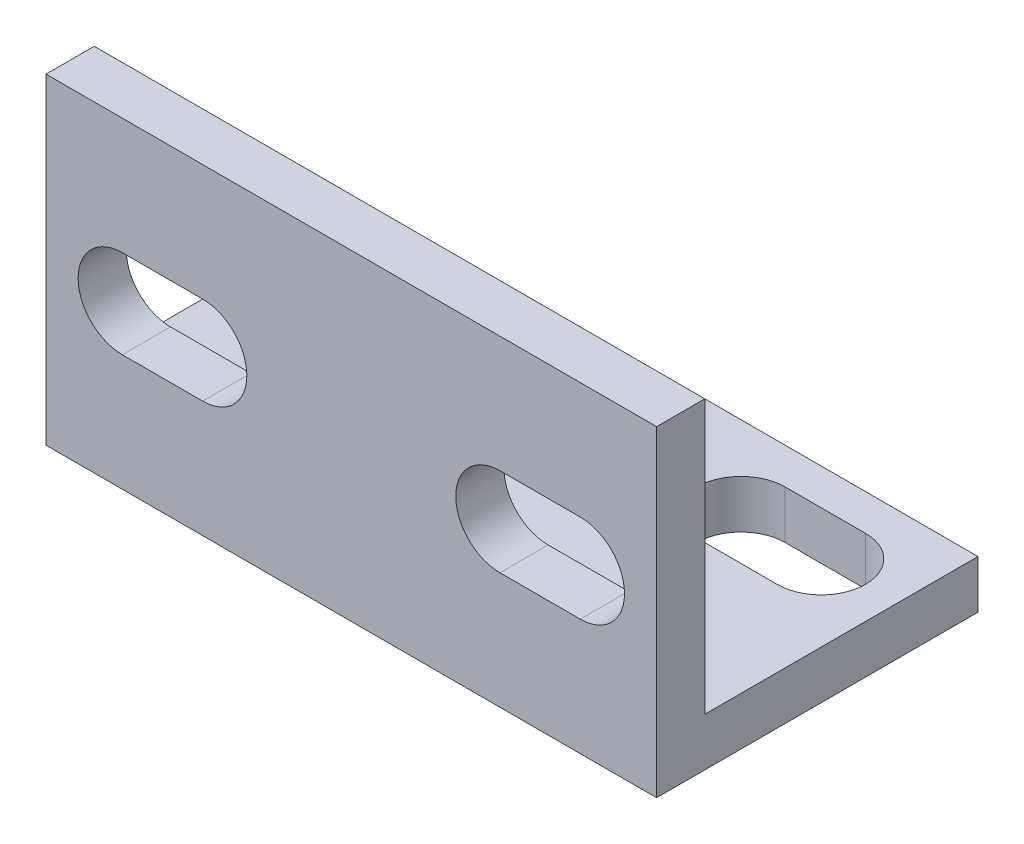
ISO-10303-21;
HEADER;
FILE_DESCRIPTION(('STEP AP214'),'2;1');
FILE_NAME('part.step','',(''),(''),'','','');
FILE_SCHEMA(('AUTOMOTIVE_DESIGN { 1 0 10303 214 1 1 1 1 }'));
ENDSEC;
DATA;
#1=APPLICATION_CONTEXT('core data for automotive mechanical design processes');
#2=APPLICATION_PROTOCOL_DEFINITION('international standard','automotive_design',2000,#1);
#3=PRODUCT_CONTEXT('',#1,'mechanical');
#4=PRODUCT('Part','Part','',(#3));
#5=PRODUCT_RELATED_PRODUCT_CATEGORY('part','',(#4));
#6=PRODUCT_DEFINITION_FORMATION('','',#4);
#7=PRODUCT_DEFINITION_CONTEXT('part definition',#1,'design');
#8=PRODUCT_DEFINITION('design','',#6,#7);
#9=PRODUCT_DEFINITION_SHAPE('','',#8);
#10=(LENGTH_UNIT() NAMED_UNIT(*) SI_UNIT(.MILLI.,.METRE.));
#11=(NAMED_UNIT(*) PLANE_ANGLE_UNIT() SI_UNIT($,.RADIAN.));
#12=(NAMED_UNIT(*) SI_UNIT($,.STERADIAN.) SOLID_ANGLE_UNIT());
#13=UNCERTAINTY_MEASURE_WITH_UNIT(LENGTH_MEASURE(1.E-05),#10,'distance_accuracy_value','');
#14=(GEOMETRIC_REPRESENTATION_CONTEXT(3) GLOBAL_UNCERTAINTY_ASSIGNED_CONTEXT((#13)) GLOBAL_UNIT_ASSIGNED_CONTEXT((#10,
#11,#12)) REPRESENTATION_CONTEXT('',''));
#15=CARTESIAN_POINT('',(0.,0.,0.));
#16=DIRECTION('',(0.,0.,1.));
#17=DIRECTION('',(1.,0.,0.));
#18=AXIS2_PLACEMENT_3D('',#15,#16,#17);
#19=CARTESIAN_POINT('',(-38.,3.,-20.));
#20=DIRECTION('',(0.,1.,0.));
#21=DIRECTION('',(0.,0.,1.));
#22=AXIS2_PLACEMENT_3D('',#19,#20,#21);
#23=PLANE('',#22);
#24=DIRECTION('',(0.,0.,1.));
#25=VECTOR('',#24,1.);
#26=CARTESIAN_POINT('',(0.,3.,-20.));
#27=LINE('',#26,#25);
#28=CARTESIAN_POINT('',(0.,3.,-20.));
#29=VERTEX_POINT('',#28);
#30=CARTESIAN_POINT('',(0.,3.,-3.));
#31=VERTEX_POINT('',#30);
#32=EDGE_CURVE('E342',#29,#31,#27,.T.);
#33=ORIENTED_EDGE('',*,*,#32,.F.);
#34=DIRECTION('',(1.,0.,0.));
#35=VECTOR('',#34,1.);
#36=CARTESIAN_POINT('',(-38.,3.,-20.));
#37=LINE('',#36,#35);
#38=CARTESIAN_POINT('',(-38.,3.,-20.));
#39=VERTEX_POINT('',#38);
#40=EDGE_CURVE('E348',#39,#29,#37,.T.);
#41=ORIENTED_EDGE('',*,*,#40,.F.);
#42=DIRECTION('',(0.,0.,1.));
#43=VECTOR('',#42,1.);
#44=CARTESIAN_POINT('',(-38.,3.,-20.));
#45=LINE('',#44,#43);
#46=CARTESIAN_POINT('',(-38.,3.,-3.));
#47=VERTEX_POINT('',#46);
#48=EDGE_CURVE('E325',#39,#47,#45,.T.);
#49=ORIENTED_EDGE('',*,*,#48,.T.);
#50=DIRECTION('',(1.,0.,0.));
#51=VECTOR('',#50,1.);
#52=CARTESIAN_POINT('',(-38.,3.,-3.));
#53=LINE('',#52,#51);
#54=EDGE_CURVE('E41',#47,#31,#53,.T.);
#55=ORIENTED_EDGE('',*,*,#54,.T.);
#56=EDGE_LOOP('',(#33,#41,#49,#55));
#57=FACE_BOUND('',#56,.T.);
#58=CARTESIAN_POINT('',(-4.75,3.,-15.));
#59=DIRECTION('',(0.,1.,0.));
#60=DIRECTION('',(0.,0.,1.));
#61=AXIS2_PLACEMENT_3D('',#58,#59,#60);
#62=CIRCLE('',#61,2.75);
#63=CARTESIAN_POINT('',(-4.75,3.,-12.25));
#64=VERTEX_POINT('',#63);
#65=CARTESIAN_POINT('',(-4.75,3.,-17.75));
#66=VERTEX_POINT('',#65);
#67=EDGE_CURVE('E242',#64,#66,#62,.T.);
#68=ORIENTED_EDGE('',*,*,#67,.F.);
#69=DIRECTION('',(1.,0.,0.));
#70=VECTOR('',#69,1.);
#71=CARTESIAN_POINT('',(-4.75,3.,-12.25));
#72=LINE('',#71,#70);
#73=CARTESIAN_POINT('',(-9.75,3.,-12.25));
#74=VERTEX_POINT('',#73);
#75=EDGE_CURVE('E253',#74,#64,#72,.T.);
#76=ORIENTED_EDGE('',*,*,#75,.F.);
#77=CARTESIAN_POINT('',(-9.75,3.,-15.));
#78=DIRECTION('',(0.,1.,0.));
#79=DIRECTION('',(0.,0.,1.));
#80=AXIS2_PLACEMENT_3D('',#77,#78,#79);
#81=CIRCLE('',#80,2.75);
#82=CARTESIAN_POINT('',(-9.75,3.,-17.75));
#83=VERTEX_POINT('',#82);
#84=EDGE_CURVE('E267',#83,#74,#81,.T.);
#85=ORIENTED_EDGE('',*,*,#84,.F.);
#86=DIRECTION('',(-1.,0.,0.));
#87=VECTOR('',#86,1.);
#88=CARTESIAN_POINT('',(-4.75,3.,-17.75));
#89=LINE('',#88,#87);
#90=EDGE_CURVE('E264',#66,#83,#89,.T.);
#91=ORIENTED_EDGE('',*,*,#90,.F.);
#92=EDGE_LOOP('',(#68,#76,#85,#91));
#93=FACE_BOUND('',#92,.T.);
#94=DIRECTION('',(-1.,0.,0.));
#95=VECTOR('',#94,1.);
#96=CARTESIAN_POINT('',(-33.25,3.,-12.25));
#97=LINE('',#96,#95);
#98=CARTESIAN_POINT('',(-28.25,3.,-12.25));
#99=VERTEX_POINT('',#98);
#100=CARTESIAN_POINT('',(-33.25,3.,-12.25));
#101=VERTEX_POINT('',#100);
#102=EDGE_CURVE('E207',#99,#101,#97,.T.);
#103=ORIENTED_EDGE('',*,*,#102,.T.);
#104=CARTESIAN_POINT('',(-33.25,3.,-15.));
#105=DIRECTION('',(0.,-1.,0.));
#106=DIRECTION('',(0.,0.,1.));
#107=AXIS2_PLACEMENT_3D('',#104,#105,#106);
#108=CIRCLE('',#107,2.75);
#109=CARTESIAN_POINT('',(-33.25,3.,-17.75));
#110=VERTEX_POINT('',#109);
#111=EDGE_CURVE('E49',#101,#110,#108,.T.);
#112=ORIENTED_EDGE('',*,*,#111,.T.);
#113=DIRECTION('',(1.,0.,0.));
#114=VECTOR('',#113,1.);
#115=CARTESIAN_POINT('',(-33.25,3.,-17.75));
#116=LINE('',#115,#114);
#117=CARTESIAN_POINT('',(-28.25,3.,-17.75));
#118=VERTEX_POINT('',#117);
#119=EDGE_CURVE('E198',#110,#118,#116,.T.);
#120=ORIENTED_EDGE('',*,*,#119,.T.);
#121=CARTESIAN_POINT('',(-28.25,3.,-15.));
#122=DIRECTION('',(0.,-1.,0.));
#123=DIRECTION('',(0.,0.,1.));
#124=AXIS2_PLACEMENT_3D('',#121,#122,#123);
#125=CIRCLE('',#124,2.75);
#126=EDGE_CURVE('E201',#118,#99,#125,.T.);
#127=ORIENTED_EDGE('',*,*,#126,.T.);
#128=EDGE_LOOP('',(#103,#112,#120,#127));
#129=FACE_BOUND('',#128,.T.);
#130=ADVANCED_FACE('F32',(#57,#93,#129),#23,.T.);
#131=CARTESIAN_POINT('',(-38.,0.,0.));
#132=DIRECTION('',(0.,-1.,0.));
#133=DIRECTION('',(0.,0.,-1.));
#134=AXIS2_PLACEMENT_3D('',#131,#132,#133);
#135=PLANE('',#134);
#136=DIRECTION('',(0.,0.,-1.));
#137=VECTOR('',#136,1.);
#138=CARTESIAN_POINT('',(0.,0.,0.));
#139=LINE('',#138,#137);
#140=CARTESIAN_POINT('',(0.,0.,0.));
#141=VERTEX_POINT('',#140);
#142=CARTESIAN_POINT('',(0.,0.,-20.));
#143=VERTEX_POINT('',#142);
#144=EDGE_CURVE('E336',#141,#143,#139,.T.);
#145=ORIENTED_EDGE('',*,*,#144,.F.);
#146=DIRECTION('',(1.,0.,0.));
#147=VECTOR('',#146,1.);
#148=CARTESIAN_POINT('',(-38.,0.,0.));
#149=LINE('',#148,#147);
#150=CARTESIAN_POINT('',(-38.,0.,0.));
#151=VERTEX_POINT('',#150);
#152=EDGE_CURVE('E351',#151,#141,#149,.T.);
#153=ORIENTED_EDGE('',*,*,#152,.F.);
#154=DIRECTION('',(0.,0.,-1.));
#155=VECTOR('',#154,1.);
#156=CARTESIAN_POINT('',(-38.,0.,0.));
#157=LINE('',#156,#155);
#158=CARTESIAN_POINT('',(-38.,0.,-20.));
#159=VERTEX_POINT('',#158);
#160=EDGE_CURVE('E319',#151,#159,#157,.T.);
#161=ORIENTED_EDGE('',*,*,#160,.T.);
#162=DIRECTION('',(1.,0.,0.));
#163=VECTOR('',#162,1.);
#164=CARTESIAN_POINT('',(-38.,0.,-20.));
#165=LINE('',#164,#163);
#166=EDGE_CURVE('E350',#159,#143,#165,.T.);
#167=ORIENTED_EDGE('',*,*,#166,.T.);
#168=EDGE_LOOP('',(#145,#153,#161,#167));
#169=FACE_BOUND('',#168,.T.);
#170=CARTESIAN_POINT('',(-4.75,0.,-15.));
#171=DIRECTION('',(0.,1.,0.));
#172=DIRECTION('',(0.,0.,1.));
#173=AXIS2_PLACEMENT_3D('',#170,#171,#172);
#174=CIRCLE('',#173,2.75);
#175=CARTESIAN_POINT('',(-4.75,0.,-12.25));
#176=VERTEX_POINT('',#175);
#177=CARTESIAN_POINT('',(-4.75,0.,-17.75));
#178=VERTEX_POINT('',#177);
#179=EDGE_CURVE('E249',#176,#178,#174,.T.);
#180=ORIENTED_EDGE('',*,*,#179,.T.);
#181=DIRECTION('',(-1.,0.,0.));
#182=VECTOR('',#181,1.);
#183=CARTESIAN_POINT('',(-4.75,0.,-17.75));
#184=LINE('',#183,#182);
#185=CARTESIAN_POINT('',(-9.75,0.,-17.75));
#186=VERTEX_POINT('',#185);
#187=EDGE_CURVE('E252',#178,#186,#184,.T.);
#188=ORIENTED_EDGE('',*,*,#187,.T.);
#189=CARTESIAN_POINT('',(-9.75,0.,-15.));
#190=DIRECTION('',(0.,1.,0.));
#191=DIRECTION('',(0.,0.,1.));
#192=AXIS2_PLACEMENT_3D('',#189,#190,#191);
#193=CIRCLE('',#192,2.75);
#194=CARTESIAN_POINT('',(-9.75,0.,-12.25));
#195=VERTEX_POINT('',#194);
#196=EDGE_CURVE('E256',#186,#195,#193,.T.);
#197=ORIENTED_EDGE('',*,*,#196,.T.);
#198=DIRECTION('',(1.,0.,0.));
#199=VECTOR('',#198,1.);
#200=CARTESIAN_POINT('',(-4.75,0.,-12.25));
#201=LINE('',#200,#199);
#202=EDGE_CURVE('E259',#195,#176,#201,.T.);
#203=ORIENTED_EDGE('',*,*,#202,.T.);
#204=EDGE_LOOP('',(#180,#188,#197,#203));
#205=FACE_BOUND('',#204,.T.);
#206=DIRECTION('',(1.,0.,0.));
#207=VECTOR('',#206,1.);
#208=CARTESIAN_POINT('',(-33.25,0.,-17.75));
#209=LINE('',#208,#207);
#210=CARTESIAN_POINT('',(-33.25,0.,-17.75));
#211=VERTEX_POINT('',#210);
#212=CARTESIAN_POINT('',(-28.25,0.,-17.75));
#213=VERTEX_POINT('',#212);
#214=EDGE_CURVE('E194',#211,#213,#209,.T.);
#215=ORIENTED_EDGE('',*,*,#214,.F.);
#216=CARTESIAN_POINT('',(-33.25,0.,-15.));
#217=DIRECTION('',(0.,-1.,0.));
#218=DIRECTION('',(0.,0.,1.));
#219=AXIS2_PLACEMENT_3D('',#216,#217,#218);
#220=CIRCLE('',#219,2.75);
#221=CARTESIAN_POINT('',(-33.25,0.,-12.25));
#222=VERTEX_POINT('',#221);
#223=EDGE_CURVE('E190',#222,#211,#220,.T.);
#224=ORIENTED_EDGE('',*,*,#223,.F.);
#225=DIRECTION('',(-1.,0.,0.));
#226=VECTOR('',#225,1.);
#227=CARTESIAN_POINT('',(-33.25,0.,-12.25));
#228=LINE('',#227,#226);
#229=CARTESIAN_POINT('',(-28.25,0.,-12.25));
#230=VERTEX_POINT('',#229);
#231=EDGE_CURVE('E182',#230,#222,#228,.T.);
#232=ORIENTED_EDGE('',*,*,#231,.F.);
#233=CARTESIAN_POINT('',(-28.25,0.,-15.));
#234=DIRECTION('',(0.,-1.,0.));
#235=DIRECTION('',(0.,0.,1.));
#236=AXIS2_PLACEMENT_3D('',#233,#234,#235);
#237=CIRCLE('',#236,2.75);
#238=EDGE_CURVE('E189',#213,#230,#237,.T.);
#239=ORIENTED_EDGE('',*,*,#238,.F.);
#240=EDGE_LOOP('',(#215,#224,#232,#239));
#241=FACE_BOUND('',#240,.T.);
#242=ADVANCED_FACE('F197',(#169,#205,#241),#135,.T.);
#243=CARTESIAN_POINT('',(-38.,3.,-3.));
#244=DIRECTION('',(0.,0.,-1.));
#245=DIRECTION('',(0.,1.,0.));
#246=AXIS2_PLACEMENT_3D('',#243,#244,#245);
#247=PLANE('',#246);
#248=DIRECTION('',(0.,1.,0.));
#249=VECTOR('',#248,1.);
#250=CARTESIAN_POINT('',(0.,3.,-3.));
#251=LINE('',#250,#249);
#252=CARTESIAN_POINT('',(0.,20.,-3.));
#253=VERTEX_POINT('',#252);
#254=EDGE_CURVE('E316',#31,#253,#251,.T.);
#255=ORIENTED_EDGE('',*,*,#254,.F.);
#256=ORIENTED_EDGE('',*,*,#54,.F.);
#257=DIRECTION('',(0.,1.,0.));
#258=VECTOR('',#257,1.);
#259=CARTESIAN_POINT('',(-38.,3.,-3.));
#260=LINE('',#259,#258);
#261=CARTESIAN_POINT('',(-38.,20.,-3.));
#262=VERTEX_POINT('',#261);
#263=EDGE_CURVE('E328',#47,#262,#260,.T.);
#264=ORIENTED_EDGE('',*,*,#263,.T.);
#265=DIRECTION('',(1.,0.,0.));
#266=VECTOR('',#265,1.);
#267=CARTESIAN_POINT('',(-38.,20.,-3.));
#268=LINE('',#267,#266);
#269=EDGE_CURVE('E11',#262,#253,#268,.T.);
#270=ORIENTED_EDGE('',*,*,#269,.T.);
#271=EDGE_LOOP('',(#255,#256,#264,#270));
#272=FACE_BOUND('',#271,.T.);
#273=CARTESIAN_POINT('',(-4.75,10.,-3.));
#274=DIRECTION('',(0.,0.,-1.));
#275=DIRECTION('',(0.,1.,0.));
#276=AXIS2_PLACEMENT_3D('',#273,#274,#275);
#277=CIRCLE('',#276,2.75);
#278=CARTESIAN_POINT('',(-4.75,12.75,-3.));
#279=VERTEX_POINT('',#278);
#280=CARTESIAN_POINT('',(-4.75,7.25000000000001,-3.));
#281=VERTEX_POINT('',#280);
#282=EDGE_CURVE('E274',#279,#281,#277,.T.);
#283=ORIENTED_EDGE('',*,*,#282,.F.);
#284=DIRECTION('',(-1.,0.,0.));
#285=VECTOR('',#284,1.);
#286=CARTESIAN_POINT('',(-4.75,12.75,-3.));
#287=LINE('',#286,#285);
#288=CARTESIAN_POINT('',(-9.75,12.75,-3.));
#289=VERTEX_POINT('',#288);
#290=EDGE_CURVE('E285',#279,#289,#287,.T.);
#291=ORIENTED_EDGE('',*,*,#290,.T.);
#292=CARTESIAN_POINT('',(-9.75,10.,-3.));
#293=DIRECTION('',(0.,0.,-1.));
#294=DIRECTION('',(0.,1.,0.));
#295=AXIS2_PLACEMENT_3D('',#292,#293,#294);
#296=CIRCLE('',#295,2.75);
#297=CARTESIAN_POINT('',(-9.75,7.25000000000001,-3.));
#298=VERTEX_POINT('',#297);
#299=EDGE_CURVE('E298',#298,#289,#296,.T.);
#300=ORIENTED_EDGE('',*,*,#299,.F.);
#301=DIRECTION('',(-1.,0.,0.));
#302=VECTOR('',#301,1.);
#303=CARTESIAN_POINT('',(-4.75,7.25000000000001,-3.));
#304=LINE('',#303,#302);
#305=EDGE_CURVE('E295',#281,#298,#304,.T.);
#306=ORIENTED_EDGE('',*,*,#305,.F.);
#307=EDGE_LOOP('',(#283,#291,#300,#306));
#308=FACE_BOUND('',#307,.T.);
#309=DIRECTION('',(1.,0.,0.));
#310=VECTOR('',#309,1.);
#311=CARTESIAN_POINT('',(-33.25,12.75,-3.));
#312=LINE('',#311,#310);
#313=CARTESIAN_POINT('',(-33.25,12.75,-3.));
#314=VERTEX_POINT('',#313);
#315=CARTESIAN_POINT('',(-28.25,12.75,-3.));
#316=VERTEX_POINT('',#315);
#317=EDGE_CURVE('E231',#314,#316,#312,.T.);
#318=ORIENTED_EDGE('',*,*,#317,.F.);
#319=CARTESIAN_POINT('',(-33.25,10.,-3.));
#320=DIRECTION('',(0.,0.,1.));
#321=DIRECTION('',(0.,1.,0.));
#322=AXIS2_PLACEMENT_3D('',#319,#320,#321);
#323=CIRCLE('',#322,2.75);
#324=CARTESIAN_POINT('',(-33.25,7.25000000000001,-3.));
#325=VERTEX_POINT('',#324);
#326=EDGE_CURVE('E213',#314,#325,#323,.T.);
#327=ORIENTED_EDGE('',*,*,#326,.T.);
#328=DIRECTION('',(1.,0.,0.));
#329=VECTOR('',#328,1.);
#330=CARTESIAN_POINT('',(-33.25,7.25000000000001,-3.));
#331=LINE('',#330,#329);
#332=CARTESIAN_POINT('',(-28.25,7.25000000000001,-3.));
#333=VERTEX_POINT('',#332);
#334=EDGE_CURVE('E220',#325,#333,#331,.T.);
#335=ORIENTED_EDGE('',*,*,#334,.T.);
#336=CARTESIAN_POINT('',(-28.25,10.,-3.));
#337=DIRECTION('',(0.,0.,1.));
#338=DIRECTION('',(0.,1.,0.));
#339=AXIS2_PLACEMENT_3D('',#336,#337,#338);
#340=CIRCLE('',#339,2.75);
#341=EDGE_CURVE('E234',#333,#316,#340,.T.);
#342=ORIENTED_EDGE('',*,*,#341,.T.);
#343=EDGE_LOOP('',(#318,#327,#335,#342));
#344=FACE_BOUND('',#343,.T.);
#345=ADVANCED_FACE('F366',(#272,#308,#344),#247,.T.);
#346=CARTESIAN_POINT('',(-38.,20.,0.));
#347=DIRECTION('',(0.,0.,1.));
#348=DIRECTION('',(0.,-1.,0.));
#349=AXIS2_PLACEMENT_3D('',#346,#347,#348);
#350=PLANE('',#349);
#351=DIRECTION('',(0.,-1.,0.));
#352=VECTOR('',#351,1.);
#353=CARTESIAN_POINT('',(0.,20.,0.));
#354=LINE('',#353,#352);
#355=CARTESIAN_POINT('',(0.,20.,0.));
#356=VERTEX_POINT('',#355);
#357=EDGE_CURVE('E333',#356,#141,#354,.T.);
#358=ORIENTED_EDGE('',*,*,#357,.F.);
#359=DIRECTION('',(1.,0.,0.));
#360=VECTOR('',#359,1.);
#361=CARTESIAN_POINT('',(-38.,20.,0.));
#362=LINE('',#361,#360);
#363=CARTESIAN_POINT('',(-38.,20.,0.));
#364=VERTEX_POINT('',#363);
#365=EDGE_CURVE('E36',#364,#356,#362,.T.);
#366=ORIENTED_EDGE('',*,*,#365,.F.);
#367=DIRECTION('',(0.,-1.,0.));
#368=VECTOR('',#367,1.);
#369=CARTESIAN_POINT('',(-38.,20.,0.));
#370=LINE('',#369,#368);
#371=EDGE_CURVE('E315',#364,#151,#370,.T.);
#372=ORIENTED_EDGE('',*,*,#371,.T.);
#373=ORIENTED_EDGE('',*,*,#152,.T.);
#374=EDGE_LOOP('',(#358,#366,#372,#373));
#375=FACE_BOUND('',#374,.T.);
#376=CARTESIAN_POINT('',(-4.75,10.,0.));
#377=DIRECTION('',(0.,0.,-1.));
#378=DIRECTION('',(0.,1.,0.));
#379=AXIS2_PLACEMENT_3D('',#376,#377,#378);
#380=CIRCLE('',#379,2.75);
#381=CARTESIAN_POINT('',(-4.75,12.75,0.));
#382=VERTEX_POINT('',#381);
#383=CARTESIAN_POINT('',(-4.75,7.25000000000001,0.));
#384=VERTEX_POINT('',#383);
#385=EDGE_CURVE('E281',#382,#384,#380,.T.);
#386=ORIENTED_EDGE('',*,*,#385,.T.);
#387=DIRECTION('',(-1.,0.,0.));
#388=VECTOR('',#387,1.);
#389=CARTESIAN_POINT('',(-4.75,7.25000000000001,0.));
#390=LINE('',#389,#388);
#391=CARTESIAN_POINT('',(-9.75,7.25000000000001,0.));
#392=VERTEX_POINT('',#391);
#393=EDGE_CURVE('E284',#384,#392,#390,.T.);
#394=ORIENTED_EDGE('',*,*,#393,.T.);
#395=CARTESIAN_POINT('',(-9.75,10.,0.));
#396=DIRECTION('',(0.,0.,-1.));
#397=DIRECTION('',(0.,1.,0.));
#398=AXIS2_PLACEMENT_3D('',#395,#396,#397);
#399=CIRCLE('',#398,2.75);
#400=CARTESIAN_POINT('',(-9.75,12.75,0.));
#401=VERTEX_POINT('',#400);
#402=EDGE_CURVE('E288',#392,#401,#399,.T.);
#403=ORIENTED_EDGE('',*,*,#402,.T.);
#404=DIRECTION('',(-1.,0.,0.));
#405=VECTOR('',#404,1.);
#406=CARTESIAN_POINT('',(-4.75,12.75,0.));
#407=LINE('',#406,#405);
#408=EDGE_CURVE('E291',#382,#401,#407,.T.);
#409=ORIENTED_EDGE('',*,*,#408,.F.);
#410=EDGE_LOOP('',(#386,#394,#403,#409));
#411=FACE_BOUND('',#410,.T.);
#412=DIRECTION('',(1.,0.,0.));
#413=VECTOR('',#412,1.);
#414=CARTESIAN_POINT('',(-33.25,7.25000000000001,0.));
#415=LINE('',#414,#413);
#416=CARTESIAN_POINT('',(-33.25,7.25000000000001,0.));
#417=VERTEX_POINT('',#416);
#418=CARTESIAN_POINT('',(-28.25,7.25000000000001,0.));
#419=VERTEX_POINT('',#418);
#420=EDGE_CURVE('E226',#417,#419,#415,.T.);
#421=ORIENTED_EDGE('',*,*,#420,.F.);
#422=CARTESIAN_POINT('',(-33.25,10.,0.));
#423=DIRECTION('',(0.,0.,1.));
#424=DIRECTION('',(0.,1.,0.));
#425=AXIS2_PLACEMENT_3D('',#422,#423,#424);
#426=CIRCLE('',#425,2.75);
#427=CARTESIAN_POINT('',(-33.25,12.75,0.));
#428=VERTEX_POINT('',#427);
#429=EDGE_CURVE('E217',#428,#417,#426,.T.);
#430=ORIENTED_EDGE('',*,*,#429,.F.);
#431=DIRECTION('',(1.,0.,0.));
#432=VECTOR('',#431,1.);
#433=CARTESIAN_POINT('',(-33.25,12.75,0.));
#434=LINE('',#433,#432);
#435=CARTESIAN_POINT('',(-28.25,12.75,0.));
#436=VERTEX_POINT('',#435);
#437=EDGE_CURVE('E219',#428,#436,#434,.T.);
#438=ORIENTED_EDGE('',*,*,#437,.T.);
#439=CARTESIAN_POINT('',(-28.25,10.,0.));
#440=DIRECTION('',(0.,0.,1.));
#441=DIRECTION('',(0.,1.,0.));
#442=AXIS2_PLACEMENT_3D('',#439,#440,#441);
#443=CIRCLE('',#442,2.75);
#444=EDGE_CURVE('E223',#419,#436,#443,.T.);
#445=ORIENTED_EDGE('',*,*,#444,.F.);
#446=EDGE_LOOP('',(#421,#430,#438,#445));
#447=FACE_BOUND('',#446,.T.);
#448=ADVANCED_FACE('F359',(#375,#411,#447),#350,.T.);
#449=CARTESIAN_POINT('',(-38.,20.,-3.));
#450=DIRECTION('',(0.,1.,0.));
#451=DIRECTION('',(0.,0.,1.));
#452=AXIS2_PLACEMENT_3D('',#449,#450,#451);
#453=PLANE('',#452);
#454=DIRECTION('',(0.,0.,1.));
#455=VECTOR('',#454,1.);
#456=CARTESIAN_POINT('',(0.,20.,-3.));
#457=LINE('',#456,#455);
#458=EDGE_CURVE('E305',#253,#356,#457,.T.);
#459=ORIENTED_EDGE('',*,*,#458,.F.);
#460=ORIENTED_EDGE('',*,*,#269,.F.);
#461=DIRECTION('',(0.,0.,1.));
#462=VECTOR('',#461,1.);
#463=CARTESIAN_POINT('',(-38.,20.,-3.));
#464=LINE('',#463,#462);
#465=EDGE_CURVE('E312',#262,#364,#464,.T.);
#466=ORIENTED_EDGE('',*,*,#465,.T.);
#467=ORIENTED_EDGE('',*,*,#365,.T.);
#468=EDGE_LOOP('',(#459,#460,#466,#467));
#469=FACE_BOUND('',#468,.T.);
#470=ADVANCED_FACE('F34',(#469),#453,.T.);
#471=CARTESIAN_POINT('',(-38.,0.,-20.));
#472=DIRECTION('',(0.,0.,-1.));
#473=DIRECTION('',(-1.,0.,0.));
#474=AXIS2_PLACEMENT_3D('',#471,#472,#473);
#475=PLANE('',#474);
#476=DIRECTION('',(0.,1.,0.));
#477=VECTOR('',#476,1.);
#478=CARTESIAN_POINT('',(0.,0.,-20.));
#479=LINE('',#478,#477);
#480=EDGE_CURVE('E339',#143,#29,#479,.T.);
#481=ORIENTED_EDGE('',*,*,#480,.F.);
#482=ORIENTED_EDGE('',*,*,#166,.F.);
#483=DIRECTION('',(0.,1.,0.));
#484=VECTOR('',#483,1.);
#485=CARTESIAN_POINT('',(-38.,0.,-20.));
#486=LINE('',#485,#484);
#487=EDGE_CURVE('E322',#159,#39,#486,.T.);
#488=ORIENTED_EDGE('',*,*,#487,.T.);
#489=ORIENTED_EDGE('',*,*,#40,.T.);
#490=EDGE_LOOP('',(#481,#482,#488,#489));
#491=FACE_BOUND('',#490,.T.);
#492=ADVANCED_FACE('F378',(#491),#475,.T.);
#493=CARTESIAN_POINT('',(-38.,0.,0.));
#494=DIRECTION('',(1.,0.,0.));
#495=DIRECTION('',(0.,0.,-1.));
#496=AXIS2_PLACEMENT_3D('',#493,#494,#495);
#497=PLANE('',#496);
#498=ORIENTED_EDGE('',*,*,#465,.F.);
#499=ORIENTED_EDGE('',*,*,#263,.F.);
#500=ORIENTED_EDGE('',*,*,#48,.F.);
#501=ORIENTED_EDGE('',*,*,#487,.F.);
#502=ORIENTED_EDGE('',*,*,#160,.F.);
#503=ORIENTED_EDGE('',*,*,#371,.F.);
#504=EDGE_LOOP('',(#498,#499,#500,#501,#502,#503));
#505=FACE_BOUND('',#504,.T.);
#506=ADVANCED_FACE('F370',(#505),#497,.F.);
#507=CARTESIAN_POINT('',(0.,0.,0.));
#508=DIRECTION('',(1.,0.,0.));
#509=DIRECTION('',(0.,0.,-1.));
#510=AXIS2_PLACEMENT_3D('',#507,#508,#509);
#511=PLANE('',#510);
#512=ORIENTED_EDGE('',*,*,#458,.T.);
#513=ORIENTED_EDGE('',*,*,#357,.T.);
#514=ORIENTED_EDGE('',*,*,#144,.T.);
#515=ORIENTED_EDGE('',*,*,#480,.T.);
#516=ORIENTED_EDGE('',*,*,#32,.T.);
#517=ORIENTED_EDGE('',*,*,#254,.T.);
#518=EDGE_LOOP('',(#512,#513,#514,#515,#516,#517));
#519=FACE_BOUND('',#518,.T.);
#520=ADVANCED_FACE('F362',(#519),#511,.T.);
#521=CARTESIAN_POINT('',(-4.75,10.,0.));
#522=DIRECTION('',(0.,0.,-1.));
#523=DIRECTION('',(0.,1.,0.));
#524=AXIS2_PLACEMENT_3D('',#521,#522,#523);
#525=CYLINDRICAL_SURFACE('',#524,2.75);
#526=ORIENTED_EDGE('',*,*,#282,.T.);
#527=DIRECTION('',(0.,0.,-1.));
#528=VECTOR('',#527,1.);
#529=CARTESIAN_POINT('',(-4.75,7.25000000000001,0.));
#530=LINE('',#529,#528);
#531=EDGE_CURVE('E293',#384,#281,#530,.T.);
#532=ORIENTED_EDGE('',*,*,#531,.F.);
#533=ORIENTED_EDGE('',*,*,#385,.F.);
#534=DIRECTION('',(0.,0.,-1.));
#535=VECTOR('',#534,1.);
#536=CARTESIAN_POINT('',(-4.75,12.75,0.));
#537=LINE('',#536,#535);
#538=EDGE_CURVE('E303',#382,#279,#537,.T.);
#539=ORIENTED_EDGE('',*,*,#538,.T.);
#540=EDGE_LOOP('',(#526,#532,#533,#539));
#541=FACE_BOUND('',#540,.T.);
#542=ADVANCED_FACE('F441',(#541),#525,.F.);
#543=CARTESIAN_POINT('',(-4.75,12.75,0.));
#544=DIRECTION('',(0.,-1.,0.));
#545=DIRECTION('',(1.,0.,0.));
#546=AXIS2_PLACEMENT_3D('',#543,#544,#545);
#547=PLANE('',#546);
#548=ORIENTED_EDGE('',*,*,#290,.F.);
#549=ORIENTED_EDGE('',*,*,#538,.F.);
#550=ORIENTED_EDGE('',*,*,#408,.T.);
#551=DIRECTION('',(0.,0.,-1.));
#552=VECTOR('',#551,1.);
#553=CARTESIAN_POINT('',(-9.75,12.75,0.));
#554=LINE('',#553,#552);
#555=EDGE_CURVE('E306',#401,#289,#554,.T.);
#556=ORIENTED_EDGE('',*,*,#555,.T.);
#557=EDGE_LOOP('',(#548,#549,#550,#556));
#558=FACE_BOUND('',#557,.T.);
#559=ADVANCED_FACE('F437',(#558),#547,.T.);
#560=CARTESIAN_POINT('',(-9.75,10.,0.));
#561=DIRECTION('',(0.,0.,-1.));
#562=DIRECTION('',(0.,1.,0.));
#563=AXIS2_PLACEMENT_3D('',#560,#561,#562);
#564=CYLINDRICAL_SURFACE('',#563,2.75);
#565=ORIENTED_EDGE('',*,*,#299,.T.);
#566=ORIENTED_EDGE('',*,*,#555,.F.);
#567=ORIENTED_EDGE('',*,*,#402,.F.);
#568=DIRECTION('',(0.,0.,-1.));
#569=VECTOR('',#568,1.);
#570=CARTESIAN_POINT('',(-9.75,7.25000000000001,0.));
#571=LINE('',#570,#569);
#572=EDGE_CURVE('E308',#392,#298,#571,.T.);
#573=ORIENTED_EDGE('',*,*,#572,.T.);
#574=EDGE_LOOP('',(#565,#566,#567,#573));
#575=FACE_BOUND('',#574,.T.);
#576=ADVANCED_FACE('F440',(#575),#564,.F.);
#577=CARTESIAN_POINT('',(-4.75,7.25000000000001,0.));
#578=DIRECTION('',(0.,-1.,0.));
#579=DIRECTION('',(1.,0.,0.));
#580=AXIS2_PLACEMENT_3D('',#577,#578,#579);
#581=PLANE('',#580);
#582=ORIENTED_EDGE('',*,*,#305,.T.);
#583=ORIENTED_EDGE('',*,*,#572,.F.);
#584=ORIENTED_EDGE('',*,*,#393,.F.);
#585=ORIENTED_EDGE('',*,*,#531,.T.);
#586=EDGE_LOOP('',(#582,#583,#584,#585));
#587=FACE_BOUND('',#586,.T.);
#588=ADVANCED_FACE('F435',(#587),#581,.F.);
#589=CARTESIAN_POINT('',(-4.75,0.,-15.));
#590=DIRECTION('',(0.,1.,0.));
#591=DIRECTION('',(0.,0.,1.));
#592=AXIS2_PLACEMENT_3D('',#589,#590,#591);
#593=CYLINDRICAL_SURFACE('',#592,2.75);
#594=ORIENTED_EDGE('',*,*,#67,.T.);
#595=DIRECTION('',(0.,1.,0.));
#596=VECTOR('',#595,1.);
#597=CARTESIAN_POINT('',(-4.75,0.,-17.75));
#598=LINE('',#597,#596);
#599=EDGE_CURVE('E262',#178,#66,#598,.T.);
#600=ORIENTED_EDGE('',*,*,#599,.F.);
#601=ORIENTED_EDGE('',*,*,#179,.F.);
#602=DIRECTION('',(0.,1.,0.));
#603=VECTOR('',#602,1.);
#604=CARTESIAN_POINT('',(-4.75,0.,-12.25));
#605=LINE('',#604,#603);
#606=EDGE_CURVE('E272',#176,#64,#605,.T.);
#607=ORIENTED_EDGE('',*,*,#606,.T.);
#608=EDGE_LOOP('',(#594,#600,#601,#607));
#609=FACE_BOUND('',#608,.T.);
#610=ADVANCED_FACE('F425',(#609),#593,.F.);
#611=CARTESIAN_POINT('',(-4.75,0.,-12.25));
#612=DIRECTION('',(0.,0.,1.));
#613=DIRECTION('',(0.,-1.,0.));
#614=AXIS2_PLACEMENT_3D('',#611,#612,#613);
#615=PLANE('',#614);
#616=ORIENTED_EDGE('',*,*,#75,.T.);
#617=ORIENTED_EDGE('',*,*,#606,.F.);
#618=ORIENTED_EDGE('',*,*,#202,.F.);
#619=DIRECTION('',(0.,1.,0.));
#620=VECTOR('',#619,1.);
#621=CARTESIAN_POINT('',(-9.75,0.,-12.25));
#622=LINE('',#621,#620);
#623=EDGE_CURVE('E275',#195,#74,#622,.T.);
#624=ORIENTED_EDGE('',*,*,#623,.T.);
#625=EDGE_LOOP('',(#616,#617,#618,#624));
#626=FACE_BOUND('',#625,.T.);
#627=ADVANCED_FACE('F421',(#626),#615,.F.);
#628=CARTESIAN_POINT('',(-9.75,0.,-15.));
#629=DIRECTION('',(0.,1.,0.));
#630=DIRECTION('',(0.,0.,1.));
#631=AXIS2_PLACEMENT_3D('',#628,#629,#630);
#632=CYLINDRICAL_SURFACE('',#631,2.75);
#633=ORIENTED_EDGE('',*,*,#84,.T.);
#634=ORIENTED_EDGE('',*,*,#623,.F.);
#635=ORIENTED_EDGE('',*,*,#196,.F.);
#636=DIRECTION('',(0.,1.,0.));
#637=VECTOR('',#636,1.);
#638=CARTESIAN_POINT('',(-9.75,0.,-17.75));
#639=LINE('',#638,#637);
#640=EDGE_CURVE('E277',#186,#83,#639,.T.);
#641=ORIENTED_EDGE('',*,*,#640,.T.);
#642=EDGE_LOOP('',(#633,#634,#635,#641));
#643=FACE_BOUND('',#642,.T.);
#644=ADVANCED_FACE('F424',(#643),#632,.F.);
#645=CARTESIAN_POINT('',(-4.75,0.,-17.75));
#646=DIRECTION('',(0.,0.,-1.));
#647=DIRECTION('',(0.,1.,0.));
#648=AXIS2_PLACEMENT_3D('',#645,#646,#647);
#649=PLANE('',#648);
#650=ORIENTED_EDGE('',*,*,#90,.T.);
#651=ORIENTED_EDGE('',*,*,#640,.F.);
#652=ORIENTED_EDGE('',*,*,#187,.F.);
#653=ORIENTED_EDGE('',*,*,#599,.T.);
#654=EDGE_LOOP('',(#650,#651,#652,#653));
#655=FACE_BOUND('',#654,.T.);
#656=ADVANCED_FACE('F419',(#655),#649,.F.);
#657=CARTESIAN_POINT('',(-33.25,10.,0.));
#658=DIRECTION('',(0.,0.,-1.));
#659=DIRECTION('',(0.,1.,0.));
#660=AXIS2_PLACEMENT_3D('',#657,#658,#659);
#661=CYLINDRICAL_SURFACE('',#660,2.75);
#662=ORIENTED_EDGE('',*,*,#326,.F.);
#663=DIRECTION('',(0.,0.,-1.));
#664=VECTOR('',#663,1.);
#665=CARTESIAN_POINT('',(-33.25,12.75,0.));
#666=LINE('',#665,#664);
#667=EDGE_CURVE('E228',#428,#314,#666,.T.);
#668=ORIENTED_EDGE('',*,*,#667,.F.);
#669=ORIENTED_EDGE('',*,*,#429,.T.);
#670=DIRECTION('',(0.,0.,-1.));
#671=VECTOR('',#670,1.);
#672=CARTESIAN_POINT('',(-33.25,7.25000000000001,0.));
#673=LINE('',#672,#671);
#674=EDGE_CURVE('E239',#417,#325,#673,.T.);
#675=ORIENTED_EDGE('',*,*,#674,.T.);
#676=EDGE_LOOP('',(#662,#668,#669,#675));
#677=FACE_BOUND('',#676,.T.);
#678=ADVANCED_FACE('F409',(#677),#661,.F.);
#679=CARTESIAN_POINT('',(-33.25,7.25000000000001,0.));
#680=DIRECTION('',(0.,1.,0.));
#681=DIRECTION('',(-1.,0.,0.));
#682=AXIS2_PLACEMENT_3D('',#679,#680,#681);
#683=PLANE('',#682);
#684=ORIENTED_EDGE('',*,*,#334,.F.);
#685=ORIENTED_EDGE('',*,*,#674,.F.);
#686=ORIENTED_EDGE('',*,*,#420,.T.);
#687=DIRECTION('',(0.,0.,-1.));
#688=VECTOR('',#687,1.);
#689=CARTESIAN_POINT('',(-28.25,7.25000000000001,0.));
#690=LINE('',#689,#688);
#691=EDGE_CURVE('E243',#419,#333,#690,.T.);
#692=ORIENTED_EDGE('',*,*,#691,.T.);
#693=EDGE_LOOP('',(#684,#685,#686,#692));
#694=FACE_BOUND('',#693,.T.);
#695=ADVANCED_FACE('F405',(#694),#683,.T.);
#696=CARTESIAN_POINT('',(-28.25,10.,0.));
#697=DIRECTION('',(0.,0.,-1.));
#698=DIRECTION('',(0.,1.,0.));
#699=AXIS2_PLACEMENT_3D('',#696,#697,#698);
#700=CYLINDRICAL_SURFACE('',#699,2.75);
#701=ORIENTED_EDGE('',*,*,#341,.F.);
#702=ORIENTED_EDGE('',*,*,#691,.F.);
#703=ORIENTED_EDGE('',*,*,#444,.T.);
#704=DIRECTION('',(0.,0.,-1.));
#705=VECTOR('',#704,1.);
#706=CARTESIAN_POINT('',(-28.25,12.75,0.));
#707=LINE('',#706,#705);
#708=EDGE_CURVE('E245',#436,#316,#707,.T.);
#709=ORIENTED_EDGE('',*,*,#708,.T.);
#710=EDGE_LOOP('',(#701,#702,#703,#709));
#711=FACE_BOUND('',#710,.T.);
#712=ADVANCED_FACE('F408',(#711),#700,.F.);
#713=CARTESIAN_POINT('',(-33.25,12.75,0.));
#714=DIRECTION('',(0.,1.,0.));
#715=DIRECTION('',(-1.,0.,0.));
#716=AXIS2_PLACEMENT_3D('',#713,#714,#715);
#717=PLANE('',#716);
#718=ORIENTED_EDGE('',*,*,#317,.T.);
#719=ORIENTED_EDGE('',*,*,#708,.F.);
#720=ORIENTED_EDGE('',*,*,#437,.F.);
#721=ORIENTED_EDGE('',*,*,#667,.T.);
#722=EDGE_LOOP('',(#718,#719,#720,#721));
#723=FACE_BOUND('',#722,.T.);
#724=ADVANCED_FACE('F400',(#723),#717,.F.);
#725=CARTESIAN_POINT('',(-33.25,0.,-15.));
#726=DIRECTION('',(0.,1.,0.));
#727=DIRECTION('',(0.,0.,1.));
#728=AXIS2_PLACEMENT_3D('',#725,#726,#727);
#729=CYLINDRICAL_SURFACE('',#728,2.75);
#730=ORIENTED_EDGE('',*,*,#111,.F.);
#731=DIRECTION('',(0.,1.,0.));
#732=VECTOR('',#731,1.);
#733=CARTESIAN_POINT('',(-33.25,0.,-12.25));
#734=LINE('',#733,#732);
#735=EDGE_CURVE('E184',#222,#101,#734,.T.);
#736=ORIENTED_EDGE('',*,*,#735,.F.);
#737=ORIENTED_EDGE('',*,*,#223,.T.);
#738=DIRECTION('',(0.,1.,0.));
#739=VECTOR('',#738,1.);
#740=CARTESIAN_POINT('',(-33.25,0.,-17.75));
#741=LINE('',#740,#739);
#742=EDGE_CURVE('E211',#211,#110,#741,.T.);
#743=ORIENTED_EDGE('',*,*,#742,.T.);
#744=EDGE_LOOP('',(#730,#736,#737,#743));
#745=FACE_BOUND('',#744,.T.);
#746=ADVANCED_FACE('F192',(#745),#729,.F.);
#747=CARTESIAN_POINT('',(-33.25,0.,-17.75));
#748=DIRECTION('',(0.,0.,1.));
#749=DIRECTION('',(0.,-1.,0.));
#750=AXIS2_PLACEMENT_3D('',#747,#748,#749);
#751=PLANE('',#750);
#752=ORIENTED_EDGE('',*,*,#119,.F.);
#753=ORIENTED_EDGE('',*,*,#742,.F.);
#754=ORIENTED_EDGE('',*,*,#214,.T.);
#755=DIRECTION('',(0.,1.,0.));
#756=VECTOR('',#755,1.);
#757=CARTESIAN_POINT('',(-28.25,0.,-17.75));
#758=LINE('',#757,#756);
#759=EDGE_CURVE('E214',#213,#118,#758,.T.);
#760=ORIENTED_EDGE('',*,*,#759,.T.);
#761=EDGE_LOOP('',(#752,#753,#754,#760));
#762=FACE_BOUND('',#761,.T.);
#763=ADVANCED_FACE('F392',(#762),#751,.T.);
#764=CARTESIAN_POINT('',(-28.25,0.,-15.));
#765=DIRECTION('',(0.,1.,0.));
#766=DIRECTION('',(0.,0.,1.));
#767=AXIS2_PLACEMENT_3D('',#764,#765,#766);
#768=CYLINDRICAL_SURFACE('',#767,2.75);
#769=ORIENTED_EDGE('',*,*,#126,.F.);
#770=ORIENTED_EDGE('',*,*,#759,.F.);
#771=ORIENTED_EDGE('',*,*,#238,.T.);
#772=DIRECTION('',(0.,1.,0.));
#773=VECTOR('',#772,1.);
#774=CARTESIAN_POINT('',(-28.25,0.,-12.25));
#775=LINE('',#774,#773);
#776=EDGE_CURVE('E57',#230,#99,#775,.T.);
#777=ORIENTED_EDGE('',*,*,#776,.T.);
#778=EDGE_LOOP('',(#769,#770,#771,#777));
#779=FACE_BOUND('',#778,.T.);
#780=ADVANCED_FACE('F390',(#779),#768,.F.);
#781=CARTESIAN_POINT('',(-33.25,0.,-12.25));
#782=DIRECTION('',(0.,0.,-1.));
#783=DIRECTION('',(0.,1.,0.));
#784=AXIS2_PLACEMENT_3D('',#781,#782,#783);
#785=PLANE('',#784);
#786=ORIENTED_EDGE('',*,*,#102,.F.);
#787=ORIENTED_EDGE('',*,*,#776,.F.);
#788=ORIENTED_EDGE('',*,*,#231,.T.);
#789=ORIENTED_EDGE('',*,*,#735,.T.);
#790=EDGE_LOOP('',(#786,#787,#788,#789));
#791=FACE_BOUND('',#790,.T.);
#792=ADVANCED_FACE('F183',(#791),#785,.T.);
#793=CLOSED_SHELL('',(#130,#242,#345,#448,#470,#492,#506,#520,#542,#559,#576,#588,#610,#627,
#644,#656,#678,#695,#712,#724,#746,#763,#780,#792));
#794=MANIFOLD_SOLID_BREP('B2',#793);
#795=ADVANCED_BREP_SHAPE_REPRESENTATION('',(#18,#794),#14);
#796=SHAPE_DEFINITION_REPRESENTATION(#9,#795);
ENDSEC;
END-ISO-10303-21;
